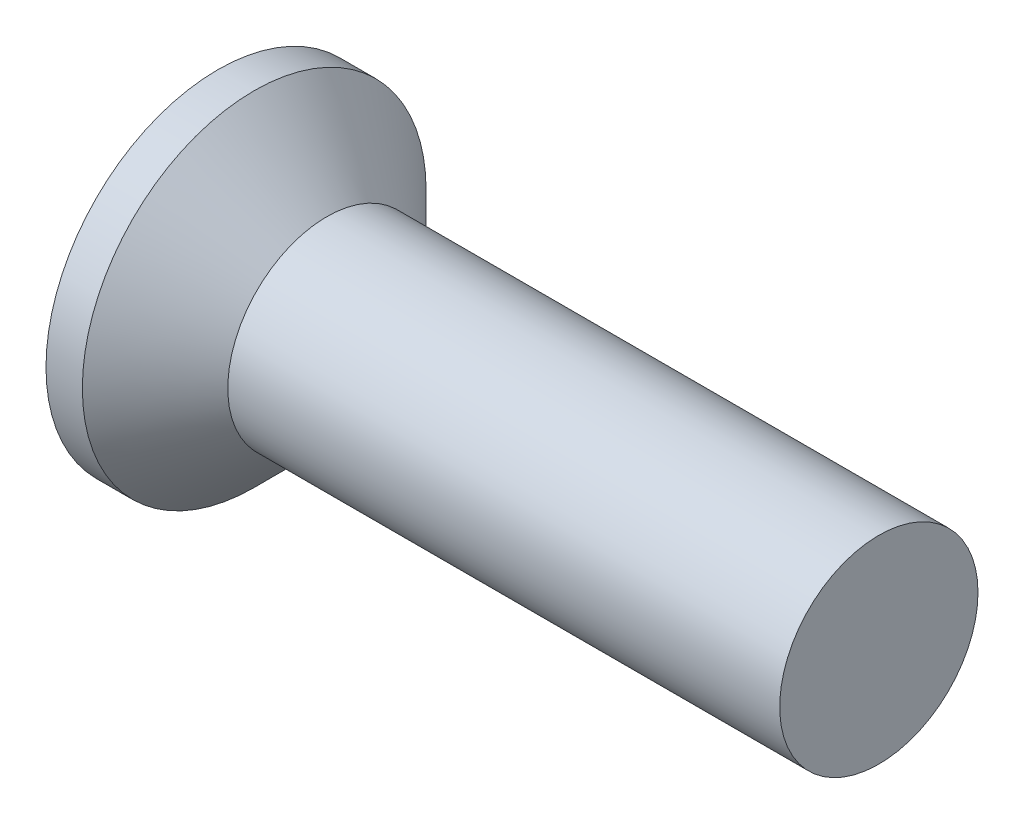
ISO-10303-21;
HEADER;
FILE_DESCRIPTION(('STEP AP214'),'2;1');
FILE_NAME('part.step','',(''),(''),'','','');
FILE_SCHEMA(('AUTOMOTIVE_DESIGN { 1 0 10303 214 1 1 1 1 }'));
ENDSEC;
DATA;
#1=APPLICATION_CONTEXT('core data for automotive mechanical design processes');
#2=APPLICATION_PROTOCOL_DEFINITION('international standard','automotive_design',2000,#1);
#3=PRODUCT_CONTEXT('',#1,'mechanical');
#4=PRODUCT('Part','Part','',(#3));
#5=PRODUCT_RELATED_PRODUCT_CATEGORY('part','',(#4));
#6=PRODUCT_DEFINITION_FORMATION('','',#4);
#7=PRODUCT_DEFINITION_CONTEXT('part definition',#1,'design');
#8=PRODUCT_DEFINITION('design','',#6,#7);
#9=PRODUCT_DEFINITION_SHAPE('','',#8);
#10=(LENGTH_UNIT() NAMED_UNIT(*) SI_UNIT(.MILLI.,.METRE.));
#11=(NAMED_UNIT(*) PLANE_ANGLE_UNIT() SI_UNIT($,.RADIAN.));
#12=(NAMED_UNIT(*) SI_UNIT($,.STERADIAN.) SOLID_ANGLE_UNIT());
#13=UNCERTAINTY_MEASURE_WITH_UNIT(LENGTH_MEASURE(1.E-05),#10,'distance_accuracy_value','');
#14=(GEOMETRIC_REPRESENTATION_CONTEXT(3) GLOBAL_UNCERTAINTY_ASSIGNED_CONTEXT((#13)) GLOBAL_UNIT_ASSIGNED_CONTEXT((#10,
#11,#12)) REPRESENTATION_CONTEXT('',''));
#15=CARTESIAN_POINT('',(0.,0.,0.));
#16=DIRECTION('',(0.,0.,1.));
#17=DIRECTION('',(1.,0.,0.));
#18=AXIS2_PLACEMENT_3D('',#15,#16,#17);
#19=CARTESIAN_POINT('',(0.,2.59999999999999,0.));
#20=DIRECTION('',(-1.,0.,0.));
#21=DIRECTION('',(0.,0.,1.));
#22=AXIS2_PLACEMENT_3D('',#19,#20,#21);
#23=PLANE('',#22);
#24=CARTESIAN_POINT('',(0.,0.,0.));
#25=DIRECTION('',(1.,0.,0.));
#26=DIRECTION('',(0.,0.,-1.));
#27=AXIS2_PLACEMENT_3D('',#24,#25,#26);
#28=CIRCLE('',#27,2.59999999999999);
#29=CARTESIAN_POINT('',(0.,0.,-2.59999999999999));
#30=VERTEX_POINT('',#29);
#31=EDGE_CURVE('E188',#30,#30,#28,.T.);
#32=ORIENTED_EDGE('',*,*,#31,.F.);
#33=EDGE_LOOP('',(#32));
#34=FACE_BOUND('',#33,.T.);
#35=DIRECTION('',(0.,1.,0.));
#36=VECTOR('',#35,1.);
#37=CARTESIAN_POINT('',(0.,-0.32,-0.32));
#38=LINE('',#37,#36);
#39=CARTESIAN_POINT('',(0.,-1.6,-0.32));
#40=VERTEX_POINT('',#39);
#41=CARTESIAN_POINT('',(0.,-0.62,-0.32));
#42=VERTEX_POINT('',#41);
#43=EDGE_CURVE('E314',#40,#42,#38,.T.);
#44=ORIENTED_EDGE('',*,*,#43,.T.);
#45=CARTESIAN_POINT('',(0.,-0.62,-0.62));
#46=DIRECTION('',(-1.,0.,0.));
#47=DIRECTION('',(0.,0.,1.));
#48=AXIS2_PLACEMENT_3D('',#45,#46,#47);
#49=CIRCLE('',#48,0.3);
#50=CARTESIAN_POINT('',(0.,-0.32,-0.62));
#51=VERTEX_POINT('',#50);
#52=EDGE_CURVE('E193',#42,#51,#49,.T.);
#53=ORIENTED_EDGE('',*,*,#52,.T.);
#54=DIRECTION('',(0.,0.,-1.));
#55=VECTOR('',#54,1.);
#56=CARTESIAN_POINT('',(0.,-0.32,-0.32));
#57=LINE('',#56,#55);
#58=CARTESIAN_POINT('',(0.,-0.32,-1.6));
#59=VERTEX_POINT('',#58);
#60=EDGE_CURVE('E316',#51,#59,#57,.T.);
#61=ORIENTED_EDGE('',*,*,#60,.T.);
#62=DIRECTION('',(0.,1.,0.));
#63=VECTOR('',#62,1.);
#64=CARTESIAN_POINT('',(0.,0.32,-1.6));
#65=LINE('',#64,#63);
#66=CARTESIAN_POINT('',(0.,0.32,-1.6));
#67=VERTEX_POINT('',#66);
#68=EDGE_CURVE('E318',#59,#67,#65,.T.);
#69=ORIENTED_EDGE('',*,*,#68,.T.);
#70=DIRECTION('',(0.,0.,1.));
#71=VECTOR('',#70,1.);
#72=CARTESIAN_POINT('',(0.,0.32,-0.32));
#73=LINE('',#72,#71);
#74=CARTESIAN_POINT('',(0.,0.32,-0.62));
#75=VERTEX_POINT('',#74);
#76=EDGE_CURVE('E321',#67,#75,#73,.T.);
#77=ORIENTED_EDGE('',*,*,#76,.T.);
#78=CARTESIAN_POINT('',(0.,0.62,-0.62));
#79=DIRECTION('',(-1.,0.,0.));
#80=DIRECTION('',(0.,0.,1.));
#81=AXIS2_PLACEMENT_3D('',#78,#79,#80);
#82=CIRCLE('',#81,0.3);
#83=CARTESIAN_POINT('',(0.,0.62,-0.32));
#84=VERTEX_POINT('',#83);
#85=EDGE_CURVE('E191',#75,#84,#82,.T.);
#86=ORIENTED_EDGE('',*,*,#85,.T.);
#87=DIRECTION('',(0.,1.,0.));
#88=VECTOR('',#87,1.);
#89=CARTESIAN_POINT('',(0.,0.32,-0.32));
#90=LINE('',#89,#88);
#91=CARTESIAN_POINT('',(0.,1.6,-0.32));
#92=VERTEX_POINT('',#91);
#93=EDGE_CURVE('E324',#84,#92,#90,.T.);
#94=ORIENTED_EDGE('',*,*,#93,.T.);
#95=DIRECTION('',(0.,0.,1.));
#96=VECTOR('',#95,1.);
#97=CARTESIAN_POINT('',(0.,1.6,-0.32));
#98=LINE('',#97,#96);
#99=CARTESIAN_POINT('',(0.,1.6,0.32));
#100=VERTEX_POINT('',#99);
#101=EDGE_CURVE('E326',#92,#100,#98,.T.);
#102=ORIENTED_EDGE('',*,*,#101,.T.);
#103=DIRECTION('',(0.,-1.,0.));
#104=VECTOR('',#103,1.);
#105=CARTESIAN_POINT('',(0.,0.32,0.32));
#106=LINE('',#105,#104);
#107=CARTESIAN_POINT('',(0.,0.62,0.32));
#108=VERTEX_POINT('',#107);
#109=EDGE_CURVE('E329',#100,#108,#106,.T.);
#110=ORIENTED_EDGE('',*,*,#109,.T.);
#111=CARTESIAN_POINT('',(0.,0.62,0.62));
#112=DIRECTION('',(-1.,0.,0.));
#113=DIRECTION('',(0.,0.,1.));
#114=AXIS2_PLACEMENT_3D('',#111,#112,#113);
#115=CIRCLE('',#114,0.3);
#116=CARTESIAN_POINT('',(0.,0.32,0.62));
#117=VERTEX_POINT('',#116);
#118=EDGE_CURVE('E156',#108,#117,#115,.T.);
#119=ORIENTED_EDGE('',*,*,#118,.T.);
#120=DIRECTION('',(0.,0.,1.));
#121=VECTOR('',#120,1.);
#122=CARTESIAN_POINT('',(0.,0.32,0.32));
#123=LINE('',#122,#121);
#124=CARTESIAN_POINT('',(0.,0.32,1.6));
#125=VERTEX_POINT('',#124);
#126=EDGE_CURVE('E150',#117,#125,#123,.T.);
#127=ORIENTED_EDGE('',*,*,#126,.T.);
#128=DIRECTION('',(0.,-1.,0.));
#129=VECTOR('',#128,1.);
#130=CARTESIAN_POINT('',(0.,0.32,1.6));
#131=LINE('',#130,#129);
#132=CARTESIAN_POINT('',(0.,-0.32,1.6));
#133=VERTEX_POINT('',#132);
#134=EDGE_CURVE('E154',#125,#133,#131,.T.);
#135=ORIENTED_EDGE('',*,*,#134,.T.);
#136=DIRECTION('',(0.,0.,-1.));
#137=VECTOR('',#136,1.);
#138=CARTESIAN_POINT('',(0.,-0.32,0.32));
#139=LINE('',#138,#137);
#140=CARTESIAN_POINT('',(0.,-0.32,0.62));
#141=VERTEX_POINT('',#140);
#142=EDGE_CURVE('E168',#133,#141,#139,.T.);
#143=ORIENTED_EDGE('',*,*,#142,.T.);
#144=CARTESIAN_POINT('',(0.,-0.62,0.62));
#145=DIRECTION('',(-1.,0.,0.));
#146=DIRECTION('',(0.,0.,1.));
#147=AXIS2_PLACEMENT_3D('',#144,#145,#146);
#148=CIRCLE('',#147,0.3);
#149=CARTESIAN_POINT('',(0.,-0.62,0.32));
#150=VERTEX_POINT('',#149);
#151=EDGE_CURVE('E187',#141,#150,#148,.T.);
#152=ORIENTED_EDGE('',*,*,#151,.T.);
#153=DIRECTION('',(0.,-1.,0.));
#154=VECTOR('',#153,1.);
#155=CARTESIAN_POINT('',(0.,-0.32,0.32));
#156=LINE('',#155,#154);
#157=CARTESIAN_POINT('',(0.,-1.6,0.319999999999999));
#158=VERTEX_POINT('',#157);
#159=EDGE_CURVE('E309',#150,#158,#156,.T.);
#160=ORIENTED_EDGE('',*,*,#159,.T.);
#161=DIRECTION('',(0.,0.,-1.));
#162=VECTOR('',#161,1.);
#163=CARTESIAN_POINT('',(0.,-1.6,-0.32));
#164=LINE('',#163,#162);
#165=EDGE_CURVE('E311',#158,#40,#164,.T.);
#166=ORIENTED_EDGE('',*,*,#165,.T.);
#167=EDGE_LOOP('',(#44,#53,#61,#69,#77,#86,#94,#102,#110,#119,#127,#135,#143,#152,#160,#166));
#168=FACE_BOUND('',#167,.T.);
#169=ADVANCED_FACE('F37',(#34,#168),#23,.T.);
#170=CARTESIAN_POINT('',(10.,1.5,0.));
#171=DIRECTION('',(1.,0.,0.));
#172=DIRECTION('',(0.,0.,-1.));
#173=AXIS2_PLACEMENT_3D('',#170,#171,#172);
#174=PLANE('',#173);
#175=CARTESIAN_POINT('',(10.,0.,0.));
#176=DIRECTION('',(1.,0.,0.));
#177=DIRECTION('',(0.,0.,-1.));
#178=AXIS2_PLACEMENT_3D('',#175,#176,#177);
#179=CIRCLE('',#178,1.5);
#180=CARTESIAN_POINT('',(10.,0.,-1.5));
#181=VERTEX_POINT('',#180);
#182=EDGE_CURVE('E174',#181,#181,#179,.T.);
#183=ORIENTED_EDGE('',*,*,#182,.T.);
#184=EDGE_LOOP('',(#183));
#185=FACE_BOUND('',#184,.T.);
#186=ADVANCED_FACE('F241',(#185),#174,.T.);
#187=CARTESIAN_POINT('',(4.51581291088132,0.,0.));
#188=DIRECTION('',(1.,0.,0.));
#189=DIRECTION('',(0.,0.,-1.));
#190=AXIS2_PLACEMENT_3D('',#187,#188,#189);
#191=CYLINDRICAL_SURFACE('',#190,2.59999999999999);
#192=ORIENTED_EDGE('',*,*,#31,.T.);
#193=EDGE_LOOP('',(#192));
#194=FACE_BOUND('',#193,.T.);
#195=CARTESIAN_POINT('',(0.550000000000005,0.,0.));
#196=DIRECTION('',(1.,0.,0.));
#197=DIRECTION('',(0.,0.,-1.));
#198=AXIS2_PLACEMENT_3D('',#195,#196,#197);
#199=CIRCLE('',#198,2.59999999999999);
#200=CARTESIAN_POINT('',(0.550000000000005,0.,-2.59999999999999));
#201=VERTEX_POINT('',#200);
#202=EDGE_CURVE('E333',#201,#201,#199,.T.);
#203=ORIENTED_EDGE('',*,*,#202,.F.);
#204=EDGE_LOOP('',(#203));
#205=FACE_BOUND('',#204,.T.);
#206=ADVANCED_FACE('F247',(#194,#205),#191,.T.);
#207=CARTESIAN_POINT('',(1.65,0.,0.));
#208=DIRECTION('',(-1.,0.,0.));
#209=DIRECTION('',(0.,0.,1.));
#210=AXIS2_PLACEMENT_3D('',#207,#208,#209);
#211=CONICAL_SURFACE('',#210,1.49999999999999,0.78539816339745);
#212=ORIENTED_EDGE('',*,*,#202,.T.);
#213=EDGE_LOOP('',(#212));
#214=FACE_BOUND('',#213,.T.);
#215=CARTESIAN_POINT('',(1.65,0.,0.));
#216=DIRECTION('',(1.,0.,0.));
#217=DIRECTION('',(0.,0.,-1.));
#218=AXIS2_PLACEMENT_3D('',#215,#216,#217);
#219=CIRCLE('',#218,1.49999999999999);
#220=CARTESIAN_POINT('',(1.65,0.,-1.49999999999999));
#221=VERTEX_POINT('',#220);
#222=EDGE_CURVE('E177',#221,#221,#219,.T.);
#223=ORIENTED_EDGE('',*,*,#222,.F.);
#224=EDGE_LOOP('',(#223));
#225=FACE_BOUND('',#224,.T.);
#226=ADVANCED_FACE('F369',(#214,#225),#211,.T.);
#227=CARTESIAN_POINT('',(4.51581291088132,0.,0.));
#228=DIRECTION('',(1.,0.,0.));
#229=DIRECTION('',(0.,0.,-1.));
#230=AXIS2_PLACEMENT_3D('',#227,#228,#229);
#231=CYLINDRICAL_SURFACE('',#230,1.5);
#232=ORIENTED_EDGE('',*,*,#222,.T.);
#233=EDGE_LOOP('',(#232));
#234=FACE_BOUND('',#233,.T.);
#235=ORIENTED_EDGE('',*,*,#182,.F.);
#236=EDGE_LOOP('',(#235));
#237=FACE_BOUND('',#236,.T.);
#238=ADVANCED_FACE('F367',(#234,#237),#231,.T.);
#239=CARTESIAN_POINT('',(0.825,0.32,0.32));
#240=DIRECTION('',(0.,-1.,0.));
#241=DIRECTION('',(0.,0.,-1.));
#242=AXIS2_PLACEMENT_3D('',#239,#240,#241);
#243=PLANE('',#242);
#244=ORIENTED_EDGE('',*,*,#126,.F.);
#245=DIRECTION('',(-1.,0.,0.));
#246=VECTOR('',#245,1.);
#247=CARTESIAN_POINT('',(0.825,0.32,0.62));
#248=LINE('',#247,#246);
#249=CARTESIAN_POINT('',(0.825,0.32,0.62));
#250=VERTEX_POINT('',#249);
#251=EDGE_CURVE('E205',#117,#250,#248,.F.);
#252=ORIENTED_EDGE('',*,*,#251,.T.);
#253=DIRECTION('',(0.,0.,1.));
#254=VECTOR('',#253,1.);
#255=CARTESIAN_POINT('',(0.825,0.32,0.32));
#256=LINE('',#255,#254);
#257=CARTESIAN_POINT('',(0.825,0.32,1.12368602791856));
#258=VERTEX_POINT('',#257);
#259=EDGE_CURVE('E172',#250,#258,#256,.T.);
#260=ORIENTED_EDGE('',*,*,#259,.T.);
#261=DIRECTION('',(-0.866025403784438,0.,0.500000000000001));
#262=VECTOR('',#261,1.);
#263=CARTESIAN_POINT('',(0.,0.32,1.6));
#264=LINE('',#263,#262);
#265=EDGE_CURVE('E164',#258,#125,#264,.T.);
#266=ORIENTED_EDGE('',*,*,#265,.T.);
#267=EDGE_LOOP('',(#244,#252,#260,#266));
#268=FACE_BOUND('',#267,.T.);
#269=ADVANCED_FACE('F170',(#268),#243,.T.);
#270=CARTESIAN_POINT('',(0.,0.32,1.6));
#271=DIRECTION('',(-0.500000000000001,0.,-0.866025403784438));
#272=DIRECTION('',(-0.866025403784438,0.,0.500000000000001));
#273=AXIS2_PLACEMENT_3D('',#270,#271,#272);
#274=PLANE('',#273);
#275=ORIENTED_EDGE('',*,*,#134,.F.);
#276=ORIENTED_EDGE('',*,*,#265,.F.);
#277=DIRECTION('',(0.,-1.,0.));
#278=VECTOR('',#277,1.);
#279=CARTESIAN_POINT('',(0.825,0.32,1.12368602791856));
#280=LINE('',#279,#278);
#281=CARTESIAN_POINT('',(0.825,-0.32,1.12368602791856));
#282=VERTEX_POINT('',#281);
#283=EDGE_CURVE('E183',#258,#282,#280,.T.);
#284=ORIENTED_EDGE('',*,*,#283,.T.);
#285=DIRECTION('',(-0.866025403784438,0.,0.500000000000001));
#286=VECTOR('',#285,1.);
#287=CARTESIAN_POINT('',(1.17300625842204,-0.32,0.922764520938917));
#288=LINE('',#287,#286);
#289=EDGE_CURVE('E166',#282,#133,#288,.T.);
#290=ORIENTED_EDGE('',*,*,#289,.T.);
#291=EDGE_LOOP('',(#275,#276,#284,#290));
#292=FACE_BOUND('',#291,.T.);
#293=ADVANCED_FACE('F163',(#292),#274,.T.);
#294=CARTESIAN_POINT('',(0.825,-0.32,0.32));
#295=DIRECTION('',(0.,1.,0.));
#296=DIRECTION('',(0.,0.,1.));
#297=AXIS2_PLACEMENT_3D('',#294,#295,#296);
#298=PLANE('',#297);
#299=DIRECTION('',(0.,0.,-1.));
#300=VECTOR('',#299,1.);
#301=CARTESIAN_POINT('',(0.825,-0.32,0.32));
#302=LINE('',#301,#300);
#303=CARTESIAN_POINT('',(0.825,-0.32,0.62));
#304=VERTEX_POINT('',#303);
#305=EDGE_CURVE('E355',#282,#304,#302,.T.);
#306=ORIENTED_EDGE('',*,*,#305,.T.);
#307=DIRECTION('',(-1.,0.,0.));
#308=VECTOR('',#307,1.);
#309=CARTESIAN_POINT('',(0.825,-0.32,0.62));
#310=LINE('',#309,#308);
#311=EDGE_CURVE('E207',#304,#141,#310,.T.);
#312=ORIENTED_EDGE('',*,*,#311,.T.);
#313=ORIENTED_EDGE('',*,*,#142,.F.);
#314=ORIENTED_EDGE('',*,*,#289,.F.);
#315=EDGE_LOOP('',(#306,#312,#313,#314));
#316=FACE_BOUND('',#315,.T.);
#317=ADVANCED_FACE('F261',(#316),#298,.T.);
#318=CARTESIAN_POINT('',(0.825,-0.32,0.32));
#319=DIRECTION('',(0.,0.,-1.));
#320=DIRECTION('',(0.,1.,0.));
#321=AXIS2_PLACEMENT_3D('',#318,#319,#320);
#322=PLANE('',#321);
#323=ORIENTED_EDGE('',*,*,#159,.F.);
#324=DIRECTION('',(-1.,0.,0.));
#325=VECTOR('',#324,1.);
#326=CARTESIAN_POINT('',(0.825,-0.62,0.32));
#327=LINE('',#326,#325);
#328=CARTESIAN_POINT('',(0.825,-0.62,0.32));
#329=VERTEX_POINT('',#328);
#330=EDGE_CURVE('E52',#150,#329,#327,.F.);
#331=ORIENTED_EDGE('',*,*,#330,.T.);
#332=DIRECTION('',(0.,-1.,0.));
#333=VECTOR('',#332,1.);
#334=CARTESIAN_POINT('',(0.825,-0.32,0.32));
#335=LINE('',#334,#333);
#336=CARTESIAN_POINT('',(0.825,-1.12368602791856,0.319999999999999));
#337=VERTEX_POINT('',#336);
#338=EDGE_CURVE('E298',#329,#337,#335,.T.);
#339=ORIENTED_EDGE('',*,*,#338,.T.);
#340=DIRECTION('',(-0.866025403784438,-0.500000000000001,0.));
#341=VECTOR('',#340,1.);
#342=CARTESIAN_POINT('',(0.,-1.6,0.319999999999999));
#343=LINE('',#342,#341);
#344=EDGE_CURVE('E179',#337,#158,#343,.T.);
#345=ORIENTED_EDGE('',*,*,#344,.T.);
#346=EDGE_LOOP('',(#323,#331,#339,#345));
#347=FACE_BOUND('',#346,.T.);
#348=ADVANCED_FACE('F266',(#347),#322,.T.);
#349=CARTESIAN_POINT('',(0.,-1.6,-0.32));
#350=DIRECTION('',(-0.500000000000001,0.866025403784438,0.));
#351=DIRECTION('',(-0.866025403784438,-0.500000000000001,0.));
#352=AXIS2_PLACEMENT_3D('',#349,#350,#351);
#353=PLANE('',#352);
#354=ORIENTED_EDGE('',*,*,#165,.F.);
#355=ORIENTED_EDGE('',*,*,#344,.F.);
#356=DIRECTION('',(0.,0.,-1.));
#357=VECTOR('',#356,1.);
#358=CARTESIAN_POINT('',(0.825,-1.12368602791856,-0.32));
#359=LINE('',#358,#357);
#360=CARTESIAN_POINT('',(0.825,-1.12368602791856,-0.32));
#361=VERTEX_POINT('',#360);
#362=EDGE_CURVE('E294',#337,#361,#359,.T.);
#363=ORIENTED_EDGE('',*,*,#362,.T.);
#364=DIRECTION('',(-0.866025403784438,-0.500000000000001,0.));
#365=VECTOR('',#364,1.);
#366=CARTESIAN_POINT('',(1.17300625842204,-0.922764520938917,-0.32));
#367=LINE('',#366,#365);
#368=EDGE_CURVE('E293',#361,#40,#367,.T.);
#369=ORIENTED_EDGE('',*,*,#368,.T.);
#370=EDGE_LOOP('',(#354,#355,#363,#369));
#371=FACE_BOUND('',#370,.T.);
#372=ADVANCED_FACE('F262',(#371),#353,.T.);
#373=CARTESIAN_POINT('',(0.825,-0.32,-0.32));
#374=DIRECTION('',(0.,0.,1.));
#375=DIRECTION('',(0.,-1.,0.));
#376=AXIS2_PLACEMENT_3D('',#373,#374,#375);
#377=PLANE('',#376);
#378=DIRECTION('',(0.,1.,0.));
#379=VECTOR('',#378,1.);
#380=CARTESIAN_POINT('',(0.825,-0.32,-0.32));
#381=LINE('',#380,#379);
#382=CARTESIAN_POINT('',(0.825,-0.62,-0.32));
#383=VERTEX_POINT('',#382);
#384=EDGE_CURVE('E287',#361,#383,#381,.T.);
#385=ORIENTED_EDGE('',*,*,#384,.T.);
#386=DIRECTION('',(-1.,0.,0.));
#387=VECTOR('',#386,1.);
#388=CARTESIAN_POINT('',(0.825,-0.62,-0.32));
#389=LINE('',#388,#387);
#390=EDGE_CURVE('E184',#383,#42,#389,.T.);
#391=ORIENTED_EDGE('',*,*,#390,.T.);
#392=ORIENTED_EDGE('',*,*,#43,.F.);
#393=ORIENTED_EDGE('',*,*,#368,.F.);
#394=EDGE_LOOP('',(#385,#391,#392,#393));
#395=FACE_BOUND('',#394,.T.);
#396=ADVANCED_FACE('F265',(#395),#377,.T.);
#397=CARTESIAN_POINT('',(0.825,-0.32,-0.32));
#398=DIRECTION('',(0.,1.,0.));
#399=DIRECTION('',(0.,0.,1.));
#400=AXIS2_PLACEMENT_3D('',#397,#398,#399);
#401=PLANE('',#400);
#402=ORIENTED_EDGE('',*,*,#60,.F.);
#403=DIRECTION('',(-1.,0.,0.));
#404=VECTOR('',#403,1.);
#405=CARTESIAN_POINT('',(0.825,-0.32,-0.62));
#406=LINE('',#405,#404);
#407=CARTESIAN_POINT('',(0.825,-0.32,-0.62));
#408=VERTEX_POINT('',#407);
#409=EDGE_CURVE('E195',#51,#408,#406,.F.);
#410=ORIENTED_EDGE('',*,*,#409,.T.);
#411=DIRECTION('',(0.,0.,-1.));
#412=VECTOR('',#411,1.);
#413=CARTESIAN_POINT('',(0.825,-0.32,-0.32));
#414=LINE('',#413,#412);
#415=CARTESIAN_POINT('',(0.825,-0.32,-1.12368602791856));
#416=VERTEX_POINT('',#415);
#417=EDGE_CURVE('E289',#408,#416,#414,.T.);
#418=ORIENTED_EDGE('',*,*,#417,.T.);
#419=DIRECTION('',(-0.866025403784438,0.,-0.500000000000001));
#420=VECTOR('',#419,1.);
#421=CARTESIAN_POINT('',(0.,-0.32,-1.6));
#422=LINE('',#421,#420);
#423=EDGE_CURVE('E345',#416,#59,#422,.T.);
#424=ORIENTED_EDGE('',*,*,#423,.T.);
#425=EDGE_LOOP('',(#402,#410,#418,#424));
#426=FACE_BOUND('',#425,.T.);
#427=ADVANCED_FACE('F272',(#426),#401,.T.);
#428=CARTESIAN_POINT('',(0.,0.32,-1.6));
#429=DIRECTION('',(-0.500000000000001,0.,0.866025403784438));
#430=DIRECTION('',(0.866025403784438,0.,0.500000000000001));
#431=AXIS2_PLACEMENT_3D('',#428,#429,#430);
#432=PLANE('',#431);
#433=ORIENTED_EDGE('',*,*,#68,.F.);
#434=ORIENTED_EDGE('',*,*,#423,.F.);
#435=DIRECTION('',(0.,1.,0.));
#436=VECTOR('',#435,1.);
#437=CARTESIAN_POINT('',(0.825,0.32,-1.12368602791856));
#438=LINE('',#437,#436);
#439=CARTESIAN_POINT('',(0.825,0.32,-1.12368602791856));
#440=VERTEX_POINT('',#439);
#441=EDGE_CURVE('E296',#416,#440,#438,.T.);
#442=ORIENTED_EDGE('',*,*,#441,.T.);
#443=DIRECTION('',(-0.866025403784438,0.,-0.500000000000001));
#444=VECTOR('',#443,1.);
#445=CARTESIAN_POINT('',(1.17300625842204,0.32,-0.922764520938917));
#446=LINE('',#445,#444);
#447=EDGE_CURVE('E343',#440,#67,#446,.T.);
#448=ORIENTED_EDGE('',*,*,#447,.T.);
#449=EDGE_LOOP('',(#433,#434,#442,#448));
#450=FACE_BOUND('',#449,.T.);
#451=ADVANCED_FACE('F268',(#450),#432,.T.);
#452=CARTESIAN_POINT('',(0.825,0.32,-0.32));
#453=DIRECTION('',(0.,-1.,0.));
#454=DIRECTION('',(0.,0.,-1.));
#455=AXIS2_PLACEMENT_3D('',#452,#453,#454);
#456=PLANE('',#455);
#457=DIRECTION('',(0.,0.,1.));
#458=VECTOR('',#457,1.);
#459=CARTESIAN_POINT('',(0.825,0.32,-0.32));
#460=LINE('',#459,#458);
#461=CARTESIAN_POINT('',(0.825,0.32,-0.62));
#462=VERTEX_POINT('',#461);
#463=EDGE_CURVE('E303',#440,#462,#460,.T.);
#464=ORIENTED_EDGE('',*,*,#463,.T.);
#465=DIRECTION('',(-1.,0.,0.));
#466=VECTOR('',#465,1.);
#467=CARTESIAN_POINT('',(0.825,0.32,-0.62));
#468=LINE('',#467,#466);
#469=EDGE_CURVE('E197',#462,#75,#468,.T.);
#470=ORIENTED_EDGE('',*,*,#469,.T.);
#471=ORIENTED_EDGE('',*,*,#76,.F.);
#472=ORIENTED_EDGE('',*,*,#447,.F.);
#473=EDGE_LOOP('',(#464,#470,#471,#472));
#474=FACE_BOUND('',#473,.T.);
#475=ADVANCED_FACE('F271',(#474),#456,.T.);
#476=CARTESIAN_POINT('',(0.825,0.32,-0.32));
#477=DIRECTION('',(0.,0.,1.));
#478=DIRECTION('',(0.,-1.,0.));
#479=AXIS2_PLACEMENT_3D('',#476,#477,#478);
#480=PLANE('',#479);
#481=ORIENTED_EDGE('',*,*,#93,.F.);
#482=DIRECTION('',(-1.,0.,0.));
#483=VECTOR('',#482,1.);
#484=CARTESIAN_POINT('',(0.825,0.62,-0.32));
#485=LINE('',#484,#483);
#486=CARTESIAN_POINT('',(0.825,0.62,-0.32));
#487=VERTEX_POINT('',#486);
#488=EDGE_CURVE('E200',#84,#487,#485,.F.);
#489=ORIENTED_EDGE('',*,*,#488,.T.);
#490=DIRECTION('',(0.,1.,0.));
#491=VECTOR('',#490,1.);
#492=CARTESIAN_POINT('',(0.825,0.32,-0.32));
#493=LINE('',#492,#491);
#494=CARTESIAN_POINT('',(0.825,1.12368602791856,-0.32));
#495=VERTEX_POINT('',#494);
#496=EDGE_CURVE('E306',#487,#495,#493,.T.);
#497=ORIENTED_EDGE('',*,*,#496,.T.);
#498=DIRECTION('',(-0.866025403784438,0.500000000000001,0.));
#499=VECTOR('',#498,1.);
#500=CARTESIAN_POINT('',(0.,1.6,-0.32));
#501=LINE('',#500,#499);
#502=EDGE_CURVE('E339',#495,#92,#501,.T.);
#503=ORIENTED_EDGE('',*,*,#502,.T.);
#504=EDGE_LOOP('',(#481,#489,#497,#503));
#505=FACE_BOUND('',#504,.T.);
#506=ADVANCED_FACE('F257',(#505),#480,.T.);
#507=CARTESIAN_POINT('',(0.,1.6,-0.32));
#508=DIRECTION('',(-0.500000000000001,-0.866025403784438,0.));
#509=DIRECTION('',(0.866025403784438,-0.500000000000001,0.));
#510=AXIS2_PLACEMENT_3D('',#507,#508,#509);
#511=PLANE('',#510);
#512=ORIENTED_EDGE('',*,*,#101,.F.);
#513=ORIENTED_EDGE('',*,*,#502,.F.);
#514=DIRECTION('',(0.,0.,1.));
#515=VECTOR('',#514,1.);
#516=CARTESIAN_POINT('',(0.825,1.12368602791856,-0.32));
#517=LINE('',#516,#515);
#518=CARTESIAN_POINT('',(0.825,1.12368602791856,0.32));
#519=VERTEX_POINT('',#518);
#520=EDGE_CURVE('E227',#495,#519,#517,.T.);
#521=ORIENTED_EDGE('',*,*,#520,.T.);
#522=DIRECTION('',(-0.866025403784438,0.500000000000001,0.));
#523=VECTOR('',#522,1.);
#524=CARTESIAN_POINT('',(1.17300625842204,0.922764520938917,0.32));
#525=LINE('',#524,#523);
#526=EDGE_CURVE('E226',#519,#100,#525,.T.);
#527=ORIENTED_EDGE('',*,*,#526,.T.);
#528=EDGE_LOOP('',(#512,#513,#521,#527));
#529=FACE_BOUND('',#528,.T.);
#530=ADVANCED_FACE('F254',(#529),#511,.T.);
#531=CARTESIAN_POINT('',(0.825,0.32,0.32));
#532=DIRECTION('',(0.,0.,-1.));
#533=DIRECTION('',(0.,1.,0.));
#534=AXIS2_PLACEMENT_3D('',#531,#532,#533);
#535=PLANE('',#534);
#536=DIRECTION('',(0.,-1.,0.));
#537=VECTOR('',#536,1.);
#538=CARTESIAN_POINT('',(0.825,0.32,0.32));
#539=LINE('',#538,#537);
#540=CARTESIAN_POINT('',(0.825,0.62,0.32));
#541=VERTEX_POINT('',#540);
#542=EDGE_CURVE('E219',#519,#541,#539,.T.);
#543=ORIENTED_EDGE('',*,*,#542,.T.);
#544=DIRECTION('',(-1.,0.,0.));
#545=VECTOR('',#544,1.);
#546=CARTESIAN_POINT('',(0.825,0.62,0.32));
#547=LINE('',#546,#545);
#548=EDGE_CURVE('E202',#541,#108,#547,.T.);
#549=ORIENTED_EDGE('',*,*,#548,.T.);
#550=ORIENTED_EDGE('',*,*,#109,.F.);
#551=ORIENTED_EDGE('',*,*,#526,.F.);
#552=EDGE_LOOP('',(#543,#549,#550,#551));
#553=FACE_BOUND('',#552,.T.);
#554=ADVANCED_FACE('F224',(#553),#535,.T.);
#555=CARTESIAN_POINT('',(0.825,0.32,0.32));
#556=DIRECTION('',(1.,0.,0.));
#557=DIRECTION('',(0.,0.,-1.));
#558=AXIS2_PLACEMENT_3D('',#555,#556,#557);
#559=PLANE('',#558);
#560=ORIENTED_EDGE('',*,*,#259,.F.);
#561=CARTESIAN_POINT('',(0.825,0.62,0.62));
#562=DIRECTION('',(1.,0.,0.));
#563=DIRECTION('',(0.,0.,-1.));
#564=AXIS2_PLACEMENT_3D('',#561,#562,#563);
#565=CIRCLE('',#564,0.3);
#566=EDGE_CURVE('E45',#250,#541,#565,.T.);
#567=ORIENTED_EDGE('',*,*,#566,.T.);
#568=ORIENTED_EDGE('',*,*,#542,.F.);
#569=ORIENTED_EDGE('',*,*,#520,.F.);
#570=ORIENTED_EDGE('',*,*,#496,.F.);
#571=CARTESIAN_POINT('',(0.825,0.62,-0.62));
#572=DIRECTION('',(1.,0.,0.));
#573=DIRECTION('',(0.,0.,-1.));
#574=AXIS2_PLACEMENT_3D('',#571,#572,#573);
#575=CIRCLE('',#574,0.3);
#576=EDGE_CURVE('E213',#487,#462,#575,.T.);
#577=ORIENTED_EDGE('',*,*,#576,.T.);
#578=ORIENTED_EDGE('',*,*,#463,.F.);
#579=ORIENTED_EDGE('',*,*,#441,.F.);
#580=ORIENTED_EDGE('',*,*,#417,.F.);
#581=CARTESIAN_POINT('',(0.825,-0.62,-0.62));
#582=DIRECTION('',(1.,0.,0.));
#583=DIRECTION('',(0.,0.,-1.));
#584=AXIS2_PLACEMENT_3D('',#581,#582,#583);
#585=CIRCLE('',#584,0.3);
#586=EDGE_CURVE('E211',#408,#383,#585,.T.);
#587=ORIENTED_EDGE('',*,*,#586,.T.);
#588=ORIENTED_EDGE('',*,*,#384,.F.);
#589=ORIENTED_EDGE('',*,*,#362,.F.);
#590=ORIENTED_EDGE('',*,*,#338,.F.);
#591=CARTESIAN_POINT('',(0.825,-0.62,0.62));
#592=DIRECTION('',(1.,0.,0.));
#593=DIRECTION('',(0.,0.,-1.));
#594=AXIS2_PLACEMENT_3D('',#591,#592,#593);
#595=CIRCLE('',#594,0.3);
#596=EDGE_CURVE('E11',#329,#304,#595,.T.);
#597=ORIENTED_EDGE('',*,*,#596,.T.);
#598=ORIENTED_EDGE('',*,*,#305,.F.);
#599=ORIENTED_EDGE('',*,*,#283,.F.);
#600=EDGE_LOOP('',(#560,#567,#568,#569,#570,#577,#578,#579,#580,#587,#588,#589,#590,#597,#598,#599));
#601=FACE_BOUND('',#600,.T.);
#602=ADVANCED_FACE('F217',(#601),#559,.F.);
#603=CARTESIAN_POINT('',(0.825,-0.62,-0.62));
#604=DIRECTION('',(-1.,0.,0.));
#605=DIRECTION('',(0.,0.,1.));
#606=AXIS2_PLACEMENT_3D('',#603,#604,#605);
#607=CYLINDRICAL_SURFACE('',#606,0.3);
#608=ORIENTED_EDGE('',*,*,#586,.F.);
#609=ORIENTED_EDGE('',*,*,#409,.F.);
#610=ORIENTED_EDGE('',*,*,#52,.F.);
#611=ORIENTED_EDGE('',*,*,#390,.F.);
#612=EDGE_LOOP('',(#608,#609,#610,#611));
#613=FACE_BOUND('',#612,.T.);
#614=ADVANCED_FACE('F237',(#613),#607,.T.);
#615=CARTESIAN_POINT('',(0.825,0.62,-0.62));
#616=DIRECTION('',(-1.,0.,0.));
#617=DIRECTION('',(0.,0.,1.));
#618=AXIS2_PLACEMENT_3D('',#615,#616,#617);
#619=CYLINDRICAL_SURFACE('',#618,0.3);
#620=ORIENTED_EDGE('',*,*,#576,.F.);
#621=ORIENTED_EDGE('',*,*,#488,.F.);
#622=ORIENTED_EDGE('',*,*,#85,.F.);
#623=ORIENTED_EDGE('',*,*,#469,.F.);
#624=EDGE_LOOP('',(#620,#621,#622,#623));
#625=FACE_BOUND('',#624,.T.);
#626=ADVANCED_FACE('F231',(#625),#619,.T.);
#627=CARTESIAN_POINT('',(0.825,0.62,0.62));
#628=DIRECTION('',(-1.,0.,0.));
#629=DIRECTION('',(0.,0.,1.));
#630=AXIS2_PLACEMENT_3D('',#627,#628,#629);
#631=CYLINDRICAL_SURFACE('',#630,0.3);
#632=ORIENTED_EDGE('',*,*,#566,.F.);
#633=ORIENTED_EDGE('',*,*,#251,.F.);
#634=ORIENTED_EDGE('',*,*,#118,.F.);
#635=ORIENTED_EDGE('',*,*,#548,.F.);
#636=EDGE_LOOP('',(#632,#633,#634,#635));
#637=FACE_BOUND('',#636,.T.);
#638=ADVANCED_FACE('F229',(#637),#631,.T.);
#639=CARTESIAN_POINT('',(0.825,-0.62,0.62));
#640=DIRECTION('',(-1.,0.,0.));
#641=DIRECTION('',(0.,0.,1.));
#642=AXIS2_PLACEMENT_3D('',#639,#640,#641);
#643=CYLINDRICAL_SURFACE('',#642,0.3);
#644=ORIENTED_EDGE('',*,*,#596,.F.);
#645=ORIENTED_EDGE('',*,*,#330,.F.);
#646=ORIENTED_EDGE('',*,*,#151,.F.);
#647=ORIENTED_EDGE('',*,*,#311,.F.);
#648=EDGE_LOOP('',(#644,#645,#646,#647));
#649=FACE_BOUND('',#648,.T.);
#650=ADVANCED_FACE('F39',(#649),#643,.T.);
#651=CLOSED_SHELL('',(#169,#186,#206,#226,#238,#269,#293,#317,#348,#372,#396,#427,#451,#475,
#506,#530,#554,#602,#614,#626,#638,#650));
#652=MANIFOLD_SOLID_BREP('B2',#651);
#653=ADVANCED_BREP_SHAPE_REPRESENTATION('',(#18,#652),#14);
#654=SHAPE_DEFINITION_REPRESENTATION(#9,#653);
ENDSEC;
END-ISO-10303-21;
